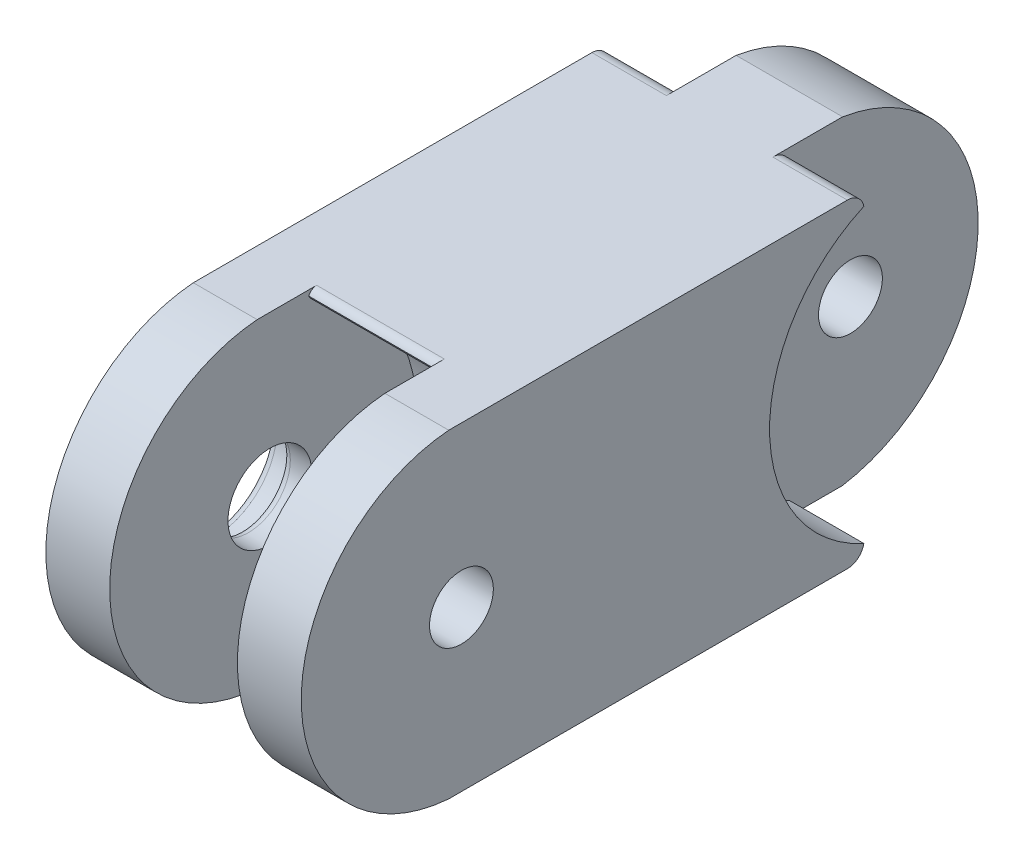
ISO-10303-21;
HEADER;
FILE_DESCRIPTION(('STEP AP214'),'2;1');
FILE_NAME('part.step','',(''),(''),'','','');
FILE_SCHEMA(('AUTOMOTIVE_DESIGN { 1 0 10303 214 1 1 1 1 }'));
ENDSEC;
DATA;
#1=APPLICATION_CONTEXT('core data for automotive mechanical design processes');
#2=APPLICATION_PROTOCOL_DEFINITION('international standard','automotive_design',2000,#1);
#3=PRODUCT_CONTEXT('',#1,'mechanical');
#4=PRODUCT('Part','Part','',(#3));
#5=PRODUCT_RELATED_PRODUCT_CATEGORY('part','',(#4));
#6=PRODUCT_DEFINITION_FORMATION('','',#4);
#7=PRODUCT_DEFINITION_CONTEXT('part definition',#1,'design');
#8=PRODUCT_DEFINITION('design','',#6,#7);
#9=PRODUCT_DEFINITION_SHAPE('','',#8);
#10=(LENGTH_UNIT() NAMED_UNIT(*) SI_UNIT(.MILLI.,.METRE.));
#11=(NAMED_UNIT(*) PLANE_ANGLE_UNIT() SI_UNIT($,.RADIAN.));
#12=(NAMED_UNIT(*) SI_UNIT($,.STERADIAN.) SOLID_ANGLE_UNIT());
#13=UNCERTAINTY_MEASURE_WITH_UNIT(LENGTH_MEASURE(1.E-05),#10,'distance_accuracy_value','');
#14=(GEOMETRIC_REPRESENTATION_CONTEXT(3) GLOBAL_UNCERTAINTY_ASSIGNED_CONTEXT((#13)) GLOBAL_UNIT_ASSIGNED_CONTEXT((#10,
#11,#12)) REPRESENTATION_CONTEXT('',''));
#15=CARTESIAN_POINT('',(0.,0.,0.));
#16=DIRECTION('',(0.,0.,1.));
#17=DIRECTION('',(1.,0.,0.));
#18=AXIS2_PLACEMENT_3D('',#15,#16,#17);
#19=CARTESIAN_POINT('',(0.,19.05,0.));
#20=DIRECTION('',(0.,1.,0.));
#21=DIRECTION('',(0.,0.,1.));
#22=AXIS2_PLACEMENT_3D('',#19,#20,#21);
#23=PLANE('',#22);
#24=DIRECTION('',(0.,0.,-1.));
#25=VECTOR('',#24,1.);
#26=CARTESIAN_POINT('',(-10.795,19.05,-27.94));
#27=LINE('',#26,#25);
#28=CARTESIAN_POINT('',(-10.795,19.05,-23.7820035976858));
#29=VERTEX_POINT('',#28);
#30=CARTESIAN_POINT('',(-10.795,19.05,-27.94));
#31=VERTEX_POINT('',#30);
#32=EDGE_CURVE('E54',#29,#31,#27,.T.);
#33=ORIENTED_EDGE('',*,*,#32,.F.);
#34=DIRECTION('',(1.,0.,0.));
#35=VECTOR('',#34,1.);
#36=CARTESIAN_POINT('',(-15.24,19.05,-23.7820035976858));
#37=LINE('',#36,#35);
#38=CARTESIAN_POINT('',(-15.24,19.05,-23.7820035976858));
#39=VERTEX_POINT('',#38);
#40=EDGE_CURVE('E303',#29,#39,#37,.F.);
#41=ORIENTED_EDGE('',*,*,#40,.T.);
#42=DIRECTION('',(0.,0.,1.));
#43=VECTOR('',#42,1.);
#44=CARTESIAN_POINT('',(-15.24,19.05,-27.94));
#45=LINE('',#44,#43);
#46=CARTESIAN_POINT('',(-15.24,19.05,0.));
#47=VERTEX_POINT('',#46);
#48=EDGE_CURVE('E214',#39,#47,#45,.T.);
#49=ORIENTED_EDGE('',*,*,#48,.T.);
#50=DIRECTION('',(1.,0.,0.));
#51=VECTOR('',#50,1.);
#52=CARTESIAN_POINT('',(-15.24,19.05,0.));
#53=LINE('',#52,#51);
#54=CARTESIAN_POINT('',(-11.43,19.05,0.));
#55=VERTEX_POINT('',#54);
#56=EDGE_CURVE('E216',#47,#55,#53,.T.);
#57=ORIENTED_EDGE('',*,*,#56,.T.);
#58=DIRECTION('',(0.,0.,-1.));
#59=VECTOR('',#58,1.);
#60=CARTESIAN_POINT('',(-11.43,19.05,0.));
#61=LINE('',#60,#59);
#62=CARTESIAN_POINT('',(-11.43,19.05,-3.548));
#63=VERTEX_POINT('',#62);
#64=EDGE_CURVE('E330',#55,#63,#61,.T.);
#65=ORIENTED_EDGE('',*,*,#64,.T.);
#66=DIRECTION('',(1.,0.,0.));
#67=VECTOR('',#66,1.);
#68=CARTESIAN_POINT('',(0.,19.05,-3.548));
#69=LINE('',#68,#67);
#70=CARTESIAN_POINT('',(-3.81,19.05,-3.548));
#71=VERTEX_POINT('',#70);
#72=EDGE_CURVE('E248',#63,#71,#69,.T.);
#73=ORIENTED_EDGE('',*,*,#72,.T.);
#74=DIRECTION('',(0.,0.,-1.));
#75=VECTOR('',#74,1.);
#76=CARTESIAN_POINT('',(-3.81,19.05,0.));
#77=LINE('',#76,#75);
#78=CARTESIAN_POINT('',(-3.81,19.05,0.));
#79=VERTEX_POINT('',#78);
#80=EDGE_CURVE('E352',#79,#71,#77,.T.);
#81=ORIENTED_EDGE('',*,*,#80,.F.);
#82=DIRECTION('',(1.,0.,0.));
#83=VECTOR('',#82,1.);
#84=CARTESIAN_POINT('',(-3.81,19.05,0.));
#85=LINE('',#84,#83);
#86=CARTESIAN_POINT('',(0.,19.05,0.));
#87=VERTEX_POINT('',#86);
#88=EDGE_CURVE('E209',#79,#87,#85,.T.);
#89=ORIENTED_EDGE('',*,*,#88,.T.);
#90=DIRECTION('',(0.,0.,-1.));
#91=VECTOR('',#90,1.);
#92=CARTESIAN_POINT('',(0.,19.05,-27.94));
#93=LINE('',#92,#91);
#94=CARTESIAN_POINT('',(0.,19.05,-23.7820035976858));
#95=VERTEX_POINT('',#94);
#96=EDGE_CURVE('E220',#87,#95,#93,.T.);
#97=ORIENTED_EDGE('',*,*,#96,.T.);
#98=DIRECTION('',(1.,0.,0.));
#99=VECTOR('',#98,1.);
#100=CARTESIAN_POINT('',(-4.445,19.05,-23.7820035976858));
#101=LINE('',#100,#99);
#102=CARTESIAN_POINT('',(-4.445,19.05,-23.7820035976858));
#103=VERTEX_POINT('',#102);
#104=EDGE_CURVE('E177',#95,#103,#101,.F.);
#105=ORIENTED_EDGE('',*,*,#104,.T.);
#106=DIRECTION('',(0.,0.,1.));
#107=VECTOR('',#106,1.);
#108=CARTESIAN_POINT('',(-4.445,19.05,-27.94));
#109=LINE('',#108,#107);
#110=CARTESIAN_POINT('',(-4.445,19.05,-27.94));
#111=VERTEX_POINT('',#110);
#112=EDGE_CURVE('E61',#111,#103,#109,.T.);
#113=ORIENTED_EDGE('',*,*,#112,.F.);
#114=DIRECTION('',(-1.,0.,0.));
#115=VECTOR('',#114,1.);
#116=CARTESIAN_POINT('',(-4.445,19.05,-27.94));
#117=LINE('',#116,#115);
#118=EDGE_CURVE('E173',#111,#31,#117,.T.);
#119=ORIENTED_EDGE('',*,*,#118,.T.);
#120=EDGE_LOOP('',(#33,#41,#49,#57,#65,#73,#81,#89,#97,#105,#113,#119));
#121=FACE_BOUND('',#120,.T.);
#122=ADVANCED_FACE('F39',(#121),#23,.T.);
#123=CARTESIAN_POINT('',(0.,0.,0.));
#124=DIRECTION('',(0.,1.,0.));
#125=DIRECTION('',(0.,0.,1.));
#126=AXIS2_PLACEMENT_3D('',#123,#124,#125);
#127=PLANE('',#126);
#128=DIRECTION('',(0.,0.,1.));
#129=VECTOR('',#128,1.);
#130=CARTESIAN_POINT('',(-15.24,0.,-27.94));
#131=LINE('',#130,#129);
#132=CARTESIAN_POINT('',(-15.24,0.,-23.7820035976858));
#133=VERTEX_POINT('',#132);
#134=CARTESIAN_POINT('',(-15.24,0.,0.));
#135=VERTEX_POINT('',#134);
#136=EDGE_CURVE('E211',#133,#135,#131,.T.);
#137=ORIENTED_EDGE('',*,*,#136,.F.);
#138=DIRECTION('',(-1.,0.,0.));
#139=VECTOR('',#138,1.);
#140=CARTESIAN_POINT('',(0.,0.,-23.7820035976858));
#141=LINE('',#140,#139);
#142=CARTESIAN_POINT('',(-10.795,0.,-23.7820035976858));
#143=VERTEX_POINT('',#142);
#144=EDGE_CURVE('E295',#133,#143,#141,.F.);
#145=ORIENTED_EDGE('',*,*,#144,.T.);
#146=DIRECTION('',(0.,0.,1.));
#147=VECTOR('',#146,1.);
#148=CARTESIAN_POINT('',(-10.795,0.,-27.94));
#149=LINE('',#148,#147);
#150=CARTESIAN_POINT('',(-10.795,0.,-27.94));
#151=VERTEX_POINT('',#150);
#152=EDGE_CURVE('E466',#151,#143,#149,.T.);
#153=ORIENTED_EDGE('',*,*,#152,.F.);
#154=DIRECTION('',(-1.,0.,0.));
#155=VECTOR('',#154,1.);
#156=CARTESIAN_POINT('',(-4.445,0.,-27.94));
#157=LINE('',#156,#155);
#158=CARTESIAN_POINT('',(-4.445,0.,-27.94));
#159=VERTEX_POINT('',#158);
#160=EDGE_CURVE('E189',#159,#151,#157,.T.);
#161=ORIENTED_EDGE('',*,*,#160,.F.);
#162=DIRECTION('',(0.,0.,-1.));
#163=VECTOR('',#162,1.);
#164=CARTESIAN_POINT('',(-4.445,0.,-27.94));
#165=LINE('',#164,#163);
#166=CARTESIAN_POINT('',(-4.445,0.,-23.7820035976858));
#167=VERTEX_POINT('',#166);
#168=EDGE_CURVE('E179',#167,#159,#165,.T.);
#169=ORIENTED_EDGE('',*,*,#168,.F.);
#170=DIRECTION('',(-1.,0.,0.));
#171=VECTOR('',#170,1.);
#172=CARTESIAN_POINT('',(0.,0.,-23.7820035976858));
#173=LINE('',#172,#171);
#174=CARTESIAN_POINT('',(0.,0.,-23.7820035976858));
#175=VERTEX_POINT('',#174);
#176=EDGE_CURVE('E293',#167,#175,#173,.F.);
#177=ORIENTED_EDGE('',*,*,#176,.T.);
#178=DIRECTION('',(0.,0.,-1.));
#179=VECTOR('',#178,1.);
#180=CARTESIAN_POINT('',(0.,0.,-27.94));
#181=LINE('',#180,#179);
#182=CARTESIAN_POINT('',(0.,0.,0.));
#183=VERTEX_POINT('',#182);
#184=EDGE_CURVE('E217',#183,#175,#181,.T.);
#185=ORIENTED_EDGE('',*,*,#184,.F.);
#186=DIRECTION('',(1.,0.,0.));
#187=VECTOR('',#186,1.);
#188=CARTESIAN_POINT('',(-3.81,0.,0.));
#189=LINE('',#188,#187);
#190=CARTESIAN_POINT('',(-3.81,0.,0.));
#191=VERTEX_POINT('',#190);
#192=EDGE_CURVE('E206',#191,#183,#189,.T.);
#193=ORIENTED_EDGE('',*,*,#192,.F.);
#194=DIRECTION('',(0.,0.,-1.));
#195=VECTOR('',#194,1.);
#196=CARTESIAN_POINT('',(-3.81,0.,0.));
#197=LINE('',#196,#195);
#198=CARTESIAN_POINT('',(-3.81,0.,-3.548));
#199=VERTEX_POINT('',#198);
#200=EDGE_CURVE('E333',#191,#199,#197,.T.);
#201=ORIENTED_EDGE('',*,*,#200,.T.);
#202=DIRECTION('',(1.,0.,0.));
#203=VECTOR('',#202,1.);
#204=CARTESIAN_POINT('',(-11.43,0.,-3.548));
#205=LINE('',#204,#203);
#206=CARTESIAN_POINT('',(-11.43,0.,-3.548));
#207=VERTEX_POINT('',#206);
#208=EDGE_CURVE('E245',#199,#207,#205,.F.);
#209=ORIENTED_EDGE('',*,*,#208,.T.);
#210=DIRECTION('',(0.,0.,-1.));
#211=VECTOR('',#210,1.);
#212=CARTESIAN_POINT('',(-11.43,0.,0.));
#213=LINE('',#212,#211);
#214=CARTESIAN_POINT('',(-11.43,0.,0.));
#215=VERTEX_POINT('',#214);
#216=EDGE_CURVE('E273',#215,#207,#213,.T.);
#217=ORIENTED_EDGE('',*,*,#216,.F.);
#218=DIRECTION('',(1.,0.,0.));
#219=VECTOR('',#218,1.);
#220=CARTESIAN_POINT('',(-15.24,0.,0.));
#221=LINE('',#220,#219);
#222=EDGE_CURVE('E224',#135,#215,#221,.T.);
#223=ORIENTED_EDGE('',*,*,#222,.F.);
#224=EDGE_LOOP('',(#137,#145,#153,#161,#169,#177,#185,#193,#201,#209,#217,#223));
#225=FACE_BOUND('',#224,.T.);
#226=ADVANCED_FACE('F387',(#225),#127,.F.);
#227=CARTESIAN_POINT('',(-11.43,9.525,0.));
#228=DIRECTION('',(1.,0.,0.));
#229=DIRECTION('',(0.,0.,-1.));
#230=AXIS2_PLACEMENT_3D('',#227,#228,#229);
#231=CYLINDRICAL_SURFACE('',#230,9.525);
#232=CARTESIAN_POINT('',(-11.43,9.525,0.));
#233=DIRECTION('',(-1.,0.,0.));
#234=DIRECTION('',(0.,0.,1.));
#235=AXIS2_PLACEMENT_3D('',#232,#233,#234);
#236=CIRCLE('',#235,9.525);
#237=CARTESIAN_POINT('',(-11.43,18.4335182930583,-3.37104239401496));
#238=VERTEX_POINT('',#237);
#239=CARTESIAN_POINT('',(-11.43,0.616481706941728,-3.37104239401496));
#240=VERTEX_POINT('',#239);
#241=EDGE_CURVE('E359',#238,#240,#236,.T.);
#242=ORIENTED_EDGE('',*,*,#241,.T.);
#243=DIRECTION('',(1.,0.,0.));
#244=VECTOR('',#243,1.);
#245=CARTESIAN_POINT('',(-11.43,0.616481706941728,-3.37104239401496));
#246=LINE('',#245,#244);
#247=CARTESIAN_POINT('',(-3.81,0.616481706941728,-3.37104239401496));
#248=VERTEX_POINT('',#247);
#249=EDGE_CURVE('E242',#240,#248,#246,.T.);
#250=ORIENTED_EDGE('',*,*,#249,.T.);
#251=CARTESIAN_POINT('',(-3.81,9.525,0.));
#252=DIRECTION('',(-1.,0.,0.));
#253=DIRECTION('',(0.,0.,1.));
#254=AXIS2_PLACEMENT_3D('',#251,#252,#253);
#255=CIRCLE('',#254,9.525);
#256=CARTESIAN_POINT('',(-3.81,18.4335182930583,-3.37104239401496));
#257=VERTEX_POINT('',#256);
#258=EDGE_CURVE('E361',#257,#248,#255,.T.);
#259=ORIENTED_EDGE('',*,*,#258,.F.);
#260=DIRECTION('',(1.,0.,0.));
#261=VECTOR('',#260,1.);
#262=CARTESIAN_POINT('',(-11.43,18.4335182930583,-3.37104239401496));
#263=LINE('',#262,#261);
#264=EDGE_CURVE('E240',#257,#238,#263,.F.);
#265=ORIENTED_EDGE('',*,*,#264,.T.);
#266=EDGE_LOOP('',(#242,#250,#259,#265));
#267=FACE_BOUND('',#266,.T.);
#268=ADVANCED_FACE('F358',(#267),#231,.F.);
#269=CARTESIAN_POINT('',(-15.24,9.525,-0.756538375766052));
#270=DIRECTION('',(1.,0.,0.));
#271=DIRECTION('',(0.,0.,-1.));
#272=AXIS2_PLACEMENT_3D('',#269,#270,#271);
#273=CYLINDRICAL_SURFACE('',#272,1.905);
#274=CARTESIAN_POINT('',(0.,9.525,-0.756538375766052));
#275=DIRECTION('',(1.,0.,0.));
#276=DIRECTION('',(0.,0.,-1.));
#277=AXIS2_PLACEMENT_3D('',#274,#275,#276);
#278=CIRCLE('',#277,1.905);
#279=CARTESIAN_POINT('',(0.,9.525,-2.66153837576605));
#280=VERTEX_POINT('',#279);
#281=EDGE_CURVE('E363',#280,#280,#278,.T.);
#282=CARTESIAN_POINT('',(-3.81,9.525,-0.756538375766052));
#283=DIRECTION('',(1.,0.,0.));
#284=DIRECTION('',(0.,0.,-1.));
#285=AXIS2_PLACEMENT_3D('',#282,#283,#284);
#286=CIRCLE('',#285,1.905);
#287=CARTESIAN_POINT('',(-3.81,9.525,-2.66153837576605));
#288=VERTEX_POINT('',#287);
#289=EDGE_CURVE('E366',#288,#288,#286,.T.);
#290=CARTESIAN_POINT('',(0.,9.525,-2.66153837576605));
#291=CARTESIAN_POINT('',(-0.0396874999999998,9.525,-2.66153837576605));
#292=CARTESIAN_POINT('',(-0.0793749999999996,9.525,-2.66153837576605));
#293=CARTESIAN_POINT('',(-0.15875,9.525,-2.66153837576605));
#294=CARTESIAN_POINT('',(-0.1984375,9.525,-2.66153837576605));
#295=CARTESIAN_POINT('',(-0.2778125,9.525,-2.66153837576605));
#296=CARTESIAN_POINT('',(-0.3175,9.525,-2.66153837576605));
#297=CARTESIAN_POINT('',(-0.396875,9.525,-2.66153837576605));
#298=CARTESIAN_POINT('',(-0.436562500000001,9.525,-2.66153837576605));
#299=CARTESIAN_POINT('',(-0.515937500000001,9.525,-2.66153837576605));
#300=CARTESIAN_POINT('',(-0.555625000000001,9.525,-2.66153837576605));
#301=CARTESIAN_POINT('',(-0.635,9.525,-2.66153837576605));
#302=CARTESIAN_POINT('',(-0.6746875,9.525,-2.66153837576605));
#303=CARTESIAN_POINT('',(-0.7540625,9.525,-2.66153837576605));
#304=CARTESIAN_POINT('',(-0.793750000000001,9.525,-2.66153837576605));
#305=CARTESIAN_POINT('',(-0.873125000000001,9.525,-2.66153837576605));
#306=CARTESIAN_POINT('',(-0.9128125,9.525,-2.66153837576605));
#307=CARTESIAN_POINT('',(-0.9921875,9.525,-2.66153837576605));
#308=CARTESIAN_POINT('',(-1.031875,9.525,-2.66153837576605));
#309=CARTESIAN_POINT('',(-1.11125,9.525,-2.66153837576605));
#310=CARTESIAN_POINT('',(-1.1509375,9.525,-2.66153837576605));
#311=CARTESIAN_POINT('',(-1.2303125,9.525,-2.66153837576605));
#312=CARTESIAN_POINT('',(-1.27,9.525,-2.66153837576605));
#313=CARTESIAN_POINT('',(-1.349375,9.525,-2.66153837576605));
#314=CARTESIAN_POINT('',(-1.3890625,9.525,-2.66153837576605));
#315=CARTESIAN_POINT('',(-1.4684375,9.525,-2.66153837576605));
#316=CARTESIAN_POINT('',(-1.508125,9.525,-2.66153837576605));
#317=CARTESIAN_POINT('',(-1.5875,9.525,-2.66153837576605));
#318=CARTESIAN_POINT('',(-1.6271875,9.525,-2.66153837576605));
#319=CARTESIAN_POINT('',(-1.7065625,9.525,-2.66153837576605));
#320=CARTESIAN_POINT('',(-1.74625,9.525,-2.66153837576605));
#321=CARTESIAN_POINT('',(-1.825625,9.525,-2.66153837576605));
#322=CARTESIAN_POINT('',(-1.8653125,9.525,-2.66153837576605));
#323=CARTESIAN_POINT('',(-1.9446875,9.525,-2.66153837576605));
#324=CARTESIAN_POINT('',(-1.984375,9.525,-2.66153837576605));
#325=CARTESIAN_POINT('',(-2.06375,9.525,-2.66153837576605));
#326=CARTESIAN_POINT('',(-2.1034375,9.525,-2.66153837576605));
#327=CARTESIAN_POINT('',(-2.1828125,9.525,-2.66153837576605));
#328=CARTESIAN_POINT('',(-2.2225,9.525,-2.66153837576605));
#329=CARTESIAN_POINT('',(-2.301875,9.525,-2.66153837576605));
#330=CARTESIAN_POINT('',(-2.3415625,9.525,-2.66153837576605));
#331=CARTESIAN_POINT('',(-2.4209375,9.525,-2.66153837576605));
#332=CARTESIAN_POINT('',(-2.460625,9.525,-2.66153837576605));
#333=CARTESIAN_POINT('',(-2.54,9.525,-2.66153837576605));
#334=CARTESIAN_POINT('',(-2.5796875,9.525,-2.66153837576605));
#335=CARTESIAN_POINT('',(-2.6590625,9.525,-2.66153837576605));
#336=CARTESIAN_POINT('',(-2.69875,9.525,-2.66153837576605));
#337=CARTESIAN_POINT('',(-2.778125,9.525,-2.66153837576605));
#338=CARTESIAN_POINT('',(-2.8178125,9.525,-2.66153837576605));
#339=CARTESIAN_POINT('',(-2.8971875,9.525,-2.66153837576605));
#340=CARTESIAN_POINT('',(-2.936875,9.525,-2.66153837576605));
#341=CARTESIAN_POINT('',(-3.01625,9.525,-2.66153837576605));
#342=CARTESIAN_POINT('',(-3.0559375,9.525,-2.66153837576605));
#343=CARTESIAN_POINT('',(-3.1353125,9.525,-2.66153837576605));
#344=CARTESIAN_POINT('',(-3.175,9.525,-2.66153837576605));
#345=CARTESIAN_POINT('',(-3.254375,9.525,-2.66153837576605));
#346=CARTESIAN_POINT('',(-3.2940625,9.525,-2.66153837576605));
#347=CARTESIAN_POINT('',(-3.3734375,9.525,-2.66153837576605));
#348=CARTESIAN_POINT('',(-3.413125,9.525,-2.66153837576605));
#349=CARTESIAN_POINT('',(-3.4925,9.525,-2.66153837576605));
#350=CARTESIAN_POINT('',(-3.5321875,9.525,-2.66153837576605));
#351=CARTESIAN_POINT('',(-3.6115625,9.525,-2.66153837576605));
#352=CARTESIAN_POINT('',(-3.65125,9.525,-2.66153837576605));
#353=CARTESIAN_POINT('',(-3.730625,9.525,-2.66153837576605));
#354=CARTESIAN_POINT('',(-3.7703125,9.525,-2.66153837576605));
#355=CARTESIAN_POINT('',(-3.81,9.525,-2.66153837576605));
#356=B_SPLINE_CURVE_WITH_KNOTS('',3,(#290,#291,#292,#293,#294,#295,#296,#297,#298,#299,#300,
#301,#302,#303,#304,#305,#306,#307,#308,#309,#310,#311,#312,#313,#314,#315,#316,#317,#318,#319,
#320,#321,#322,#323,#324,#325,#326,#327,#328,#329,#330,#331,#332,#333,#334,#335,#336,#337,#338,
#339,#340,#341,#342,#343,#344,#345,#346,#347,#348,#349,#350,#351,#352,#353,#354,#355),
.UNSPECIFIED.,.F.,.F.,(4,2,2,2,2,2,2,2,2,2,2,2,2,2,2,2,2,2,2,2,2,2,2,2,2,2,2,2,2,2,2,2,4),(0.,
0.119062499999999,0.238125,0.3571875,0.476250000000001,0.5953125,0.714375,0.833437500000001,
0.9525,1.0715625,1.190625,1.3096875,1.42875,1.5478125,1.666875,1.7859375,1.905,2.0240625,
2.143125,2.2621875,2.38125,2.5003125,2.619375,2.7384375,2.8575,2.9765625,3.095625,3.2146875,
3.33375,3.4528125,3.571875,3.6909375,3.81),.UNSPECIFIED.);
#357=EDGE_CURVE('BSEAM376',#280,#288,#356,.T.);
#358=ORIENTED_EDGE('',*,*,#281,.T.);
#359=ORIENTED_EDGE('',*,*,#289,.F.);
#360=ORIENTED_EDGE('',*,*,#357,.T.);
#361=ORIENTED_EDGE('',*,*,#357,.F.);
#362=EDGE_LOOP('',(#358,#360,#359,#361));
#363=FACE_BOUND('',#362,.T.);
#364=ADVANCED_FACE('F376',(#363),#273,.F.);
#365=CARTESIAN_POINT('',(-15.24,19.05,-27.94));
#366=DIRECTION('',(1.,0.,0.));
#367=DIRECTION('',(0.,0.,-1.));
#368=AXIS2_PLACEMENT_3D('',#365,#366,#367);
#369=PLANE('',#368);
#370=CARTESIAN_POINT('',(-15.24,9.525,-0.756538375766052));
#371=DIRECTION('',(1.,0.,0.));
#372=DIRECTION('',(0.,0.,-1.));
#373=AXIS2_PLACEMENT_3D('',#370,#371,#372);
#374=CIRCLE('',#373,4.2500052);
#375=CARTESIAN_POINT('',(-15.24,9.525,-5.00654357576605));
#376=VERTEX_POINT('',#375);
#377=EDGE_CURVE('E231',#376,#376,#374,.T.);
#378=ORIENTED_EDGE('',*,*,#377,.T.);
#379=EDGE_LOOP('',(#378));
#380=FACE_BOUND('',#379,.T.);
#381=CARTESIAN_POINT('',(-15.24,9.525,-28.6966698920937));
#382=DIRECTION('',(1.,0.,0.));
#383=DIRECTION('',(0.,0.,-1.));
#384=AXIS2_PLACEMENT_3D('',#381,#382,#383);
#385=CIRCLE('',#384,9.555007814);
#386=CARTESIAN_POINT('',(-15.24,18.2336248159629,-24.765));
#387=VERTEX_POINT('',#386);
#388=CARTESIAN_POINT('',(-15.24,0.816375184037082,-24.765));
#389=VERTEX_POINT('',#388);
#390=EDGE_CURVE('E448',#387,#389,#385,.T.);
#391=ORIENTED_EDGE('',*,*,#390,.T.);
#392=CARTESIAN_POINT('',(-15.24,1.,-23.7820035976858));
#393=DIRECTION('',(1.,0.,0.));
#394=DIRECTION('',(0.,0.,-1.));
#395=AXIS2_PLACEMENT_3D('',#392,#393,#394);
#396=CIRCLE('',#395,1.);
#397=EDGE_CURVE('E291',#389,#133,#396,.F.);
#398=ORIENTED_EDGE('',*,*,#397,.T.);
#399=ORIENTED_EDGE('',*,*,#136,.T.);
#400=CARTESIAN_POINT('',(-15.24,9.525,-0.756538375766052));
#401=DIRECTION('',(1.,0.,0.));
#402=DIRECTION('',(0.,0.,-1.));
#403=AXIS2_PLACEMENT_3D('',#400,#401,#402);
#404=CIRCLE('',#403,9.5549974);
#405=EDGE_CURVE('E196',#47,#135,#404,.T.);
#406=ORIENTED_EDGE('',*,*,#405,.F.);
#407=ORIENTED_EDGE('',*,*,#48,.F.);
#408=CARTESIAN_POINT('',(-15.24,18.05,-23.7820035976858));
#409=DIRECTION('',(1.,0.,0.));
#410=DIRECTION('',(0.,0.,-1.));
#411=AXIS2_PLACEMENT_3D('',#408,#409,#410);
#412=CIRCLE('',#411,1.);
#413=EDGE_CURVE('E289',#39,#387,#412,.F.);
#414=ORIENTED_EDGE('',*,*,#413,.T.);
#415=EDGE_LOOP('',(#391,#398,#399,#406,#407,#414));
#416=FACE_BOUND('',#415,.T.);
#417=ADVANCED_FACE('F323',(#380,#416),#369,.F.);
#418=CARTESIAN_POINT('',(0.,19.05,-27.94));
#419=DIRECTION('',(-1.,0.,0.));
#420=DIRECTION('',(0.,0.,1.));
#421=AXIS2_PLACEMENT_3D('',#418,#419,#420);
#422=PLANE('',#421);
#423=ORIENTED_EDGE('',*,*,#184,.T.);
#424=CARTESIAN_POINT('',(0.,1.,-23.7820035976858));
#425=DIRECTION('',(-1.,0.,0.));
#426=DIRECTION('',(0.,0.,1.));
#427=AXIS2_PLACEMENT_3D('',#424,#425,#426);
#428=CIRCLE('',#427,1.);
#429=CARTESIAN_POINT('',(0.,0.816375184037084,-24.765));
#430=VERTEX_POINT('',#429);
#431=EDGE_CURVE('E300',#175,#430,#428,.F.);
#432=ORIENTED_EDGE('',*,*,#431,.T.);
#433=CARTESIAN_POINT('',(0.,9.525,-28.6966698920937));
#434=DIRECTION('',(1.,0.,0.));
#435=DIRECTION('',(0.,0.,-1.));
#436=AXIS2_PLACEMENT_3D('',#433,#434,#435);
#437=CIRCLE('',#436,9.555007814);
#438=CARTESIAN_POINT('',(0.,18.2336248159629,-24.765));
#439=VERTEX_POINT('',#438);
#440=EDGE_CURVE('E368',#439,#430,#437,.T.);
#441=ORIENTED_EDGE('',*,*,#440,.F.);
#442=CARTESIAN_POINT('',(0.,18.05,-23.7820035976858));
#443=DIRECTION('',(-1.,0.,0.));
#444=DIRECTION('',(0.,0.,1.));
#445=AXIS2_PLACEMENT_3D('',#442,#443,#444);
#446=CIRCLE('',#445,1.);
#447=EDGE_CURVE('E298',#439,#95,#446,.F.);
#448=ORIENTED_EDGE('',*,*,#447,.T.);
#449=ORIENTED_EDGE('',*,*,#96,.F.);
#450=CARTESIAN_POINT('',(0.,9.525,-0.756538375766052));
#451=DIRECTION('',(1.,0.,0.));
#452=DIRECTION('',(0.,0.,-1.));
#453=AXIS2_PLACEMENT_3D('',#450,#451,#452);
#454=CIRCLE('',#453,9.5549974);
#455=EDGE_CURVE('E202',#87,#183,#454,.T.);
#456=ORIENTED_EDGE('',*,*,#455,.T.);
#457=EDGE_LOOP('',(#423,#432,#441,#448,#449,#456));
#458=FACE_BOUND('',#457,.T.);
#459=ORIENTED_EDGE('',*,*,#281,.F.);
#460=EDGE_LOOP('',(#459));
#461=FACE_BOUND('',#460,.T.);
#462=ADVANCED_FACE('F384',(#458,#461),#422,.F.);
#463=CARTESIAN_POINT('',(-3.81,9.525,-0.756538375766052));
#464=DIRECTION('',(1.,0.,0.));
#465=DIRECTION('',(0.,0.,-1.));
#466=AXIS2_PLACEMENT_3D('',#463,#464,#465);
#467=CYLINDRICAL_SURFACE('',#466,9.5549974);
#468=ORIENTED_EDGE('',*,*,#455,.F.);
#469=ORIENTED_EDGE('',*,*,#88,.F.);
#470=CARTESIAN_POINT('',(-3.81,9.525,-0.756538375766052));
#471=DIRECTION('',(1.,0.,0.));
#472=DIRECTION('',(0.,0.,-1.));
#473=AXIS2_PLACEMENT_3D('',#470,#471,#472);
#474=CIRCLE('',#473,9.5549974);
#475=EDGE_CURVE('E204',#79,#191,#474,.T.);
#476=ORIENTED_EDGE('',*,*,#475,.T.);
#477=ORIENTED_EDGE('',*,*,#192,.T.);
#478=EDGE_LOOP('',(#468,#469,#476,#477));
#479=FACE_BOUND('',#478,.T.);
#480=ADVANCED_FACE('F398',(#479),#467,.T.);
#481=CARTESIAN_POINT('',(-3.81,9.525,-0.756538375766052));
#482=DIRECTION('',(1.,0.,0.));
#483=DIRECTION('',(0.,0.,-1.));
#484=AXIS2_PLACEMENT_3D('',#481,#482,#483);
#485=PLANE('',#484);
#486=ORIENTED_EDGE('',*,*,#200,.F.);
#487=ORIENTED_EDGE('',*,*,#475,.F.);
#488=ORIENTED_EDGE('',*,*,#80,.T.);
#489=CARTESIAN_POINT('',(-3.81,18.55,-3.548));
#490=DIRECTION('',(1.,0.,0.));
#491=DIRECTION('',(0.,0.,-1.));
#492=AXIS2_PLACEMENT_3D('',#489,#490,#491);
#493=CIRCLE('',#492,0.5);
#494=CARTESIAN_POINT('',(-3.81,18.7255785242997,-3.07984171287401));
#495=VERTEX_POINT('',#494);
#496=EDGE_CURVE('E260',#71,#495,#493,.T.);
#497=ORIENTED_EDGE('',*,*,#496,.T.);
#498=CARTESIAN_POINT('',(-3.81,18.9011570485994,-3.548));
#499=DIRECTION('',(1.,0.,0.));
#500=DIRECTION('',(0.,0.,-1.));
#501=AXIS2_PLACEMENT_3D('',#498,#499,#500);
#502=CIRCLE('',#501,0.5);
#503=EDGE_CURVE('E267',#495,#257,#502,.T.);
#504=ORIENTED_EDGE('',*,*,#503,.T.);
#505=ORIENTED_EDGE('',*,*,#258,.T.);
#506=CARTESIAN_POINT('',(-3.81,0.148842951400613,-3.548));
#507=DIRECTION('',(1.,0.,0.));
#508=DIRECTION('',(0.,0.,-1.));
#509=AXIS2_PLACEMENT_3D('',#506,#507,#508);
#510=CIRCLE('',#509,0.5);
#511=CARTESIAN_POINT('',(-3.81,0.324421475700308,-3.07984171287401));
#512=VERTEX_POINT('',#511);
#513=EDGE_CURVE('E251',#248,#512,#510,.T.);
#514=ORIENTED_EDGE('',*,*,#513,.T.);
#515=CARTESIAN_POINT('',(-3.81,0.5,-3.548));
#516=DIRECTION('',(1.,0.,0.));
#517=DIRECTION('',(0.,0.,-1.));
#518=AXIS2_PLACEMENT_3D('',#515,#516,#517);
#519=CIRCLE('',#518,0.5);
#520=EDGE_CURVE('E255',#512,#199,#519,.T.);
#521=ORIENTED_EDGE('',*,*,#520,.T.);
#522=EDGE_LOOP('',(#486,#487,#488,#497,#504,#505,#514,#521));
#523=FACE_BOUND('',#522,.T.);
#524=ORIENTED_EDGE('',*,*,#289,.T.);
#525=EDGE_LOOP('',(#524));
#526=FACE_BOUND('',#525,.T.);
#527=ADVANCED_FACE('F347',(#523,#526),#485,.F.);
#528=CARTESIAN_POINT('',(-15.24,9.525,-0.756538375766052));
#529=DIRECTION('',(1.,0.,0.));
#530=DIRECTION('',(0.,0.,-1.));
#531=AXIS2_PLACEMENT_3D('',#528,#529,#530);
#532=CYLINDRICAL_SURFACE('',#531,9.5549974);
#533=CARTESIAN_POINT('',(-11.43,9.525,-0.756538375766052));
#534=DIRECTION('',(1.,0.,0.));
#535=DIRECTION('',(0.,0.,-1.));
#536=AXIS2_PLACEMENT_3D('',#533,#534,#535);
#537=CIRCLE('',#536,9.5549974);
#538=EDGE_CURVE('E194',#55,#215,#537,.T.);
#539=ORIENTED_EDGE('',*,*,#538,.F.);
#540=ORIENTED_EDGE('',*,*,#56,.F.);
#541=ORIENTED_EDGE('',*,*,#405,.T.);
#542=ORIENTED_EDGE('',*,*,#222,.T.);
#543=EDGE_LOOP('',(#539,#540,#541,#542));
#544=FACE_BOUND('',#543,.T.);
#545=ADVANCED_FACE('F329',(#544),#532,.T.);
#546=CARTESIAN_POINT('',(-11.43,9.525,-0.756538375766052));
#547=DIRECTION('',(1.,0.,0.));
#548=DIRECTION('',(0.,0.,-1.));
#549=AXIS2_PLACEMENT_3D('',#546,#547,#548);
#550=PLANE('',#549);
#551=ORIENTED_EDGE('',*,*,#538,.T.);
#552=ORIENTED_EDGE('',*,*,#216,.T.);
#553=CARTESIAN_POINT('',(-11.43,0.5,-3.548));
#554=DIRECTION('',(1.,0.,0.));
#555=DIRECTION('',(0.,0.,-1.));
#556=AXIS2_PLACEMENT_3D('',#553,#554,#555);
#557=CIRCLE('',#556,0.5);
#558=CARTESIAN_POINT('',(-11.43,0.324421475700308,-3.07984171287401));
#559=VERTEX_POINT('',#558);
#560=EDGE_CURVE('E258',#207,#559,#557,.F.);
#561=ORIENTED_EDGE('',*,*,#560,.T.);
#562=CARTESIAN_POINT('',(-11.43,0.148842951400613,-3.548));
#563=DIRECTION('',(1.,0.,0.));
#564=DIRECTION('',(0.,0.,-1.));
#565=AXIS2_PLACEMENT_3D('',#562,#563,#564);
#566=CIRCLE('',#565,0.5);
#567=EDGE_CURVE('E253',#559,#240,#566,.F.);
#568=ORIENTED_EDGE('',*,*,#567,.T.);
#569=ORIENTED_EDGE('',*,*,#241,.F.);
#570=CARTESIAN_POINT('',(-11.43,18.9011570485994,-3.548));
#571=DIRECTION('',(1.,0.,0.));
#572=DIRECTION('',(0.,0.,-1.));
#573=AXIS2_PLACEMENT_3D('',#570,#571,#572);
#574=CIRCLE('',#573,0.5);
#575=CARTESIAN_POINT('',(-11.43,18.7255785242997,-3.07984171287401));
#576=VERTEX_POINT('',#575);
#577=EDGE_CURVE('E265',#238,#576,#574,.F.);
#578=ORIENTED_EDGE('',*,*,#577,.T.);
#579=CARTESIAN_POINT('',(-11.43,18.55,-3.548));
#580=DIRECTION('',(1.,0.,0.));
#581=DIRECTION('',(0.,0.,-1.));
#582=AXIS2_PLACEMENT_3D('',#579,#580,#581);
#583=CIRCLE('',#582,0.5);
#584=EDGE_CURVE('E262',#576,#63,#583,.F.);
#585=ORIENTED_EDGE('',*,*,#584,.T.);
#586=ORIENTED_EDGE('',*,*,#64,.F.);
#587=EDGE_LOOP('',(#551,#552,#561,#568,#569,#578,#585,#586));
#588=FACE_BOUND('',#587,.T.);
#589=CARTESIAN_POINT('',(-11.43,9.525,-0.756538375766052));
#590=DIRECTION('',(1.,0.,0.));
#591=DIRECTION('',(0.,0.,-1.));
#592=AXIS2_PLACEMENT_3D('',#589,#590,#591);
#593=CIRCLE('',#592,2.499995);
#594=CARTESIAN_POINT('',(-11.43,9.525,-3.25653337576605));
#595=VERTEX_POINT('',#594);
#596=EDGE_CURVE('E455',#595,#595,#593,.F.);
#597=ORIENTED_EDGE('',*,*,#596,.T.);
#598=EDGE_LOOP('',(#597));
#599=FACE_BOUND('',#598,.T.);
#600=ADVANCED_FACE('F336',(#588,#599),#550,.T.);
#601=CARTESIAN_POINT('',(-4.445,9.525,-26.3793978726146));
#602=DIRECTION('',(-1.,0.,0.));
#603=DIRECTION('',(0.,0.,1.));
#604=AXIS2_PLACEMENT_3D('',#601,#602,#603);
#605=CYLINDRICAL_SURFACE('',#604,9.652);
#606=CARTESIAN_POINT('',(-10.795,9.525,-26.3793978726146));
#607=DIRECTION('',(1.,0.,0.));
#608=DIRECTION('',(0.,0.,1.));
#609=AXIS2_PLACEMENT_3D('',#606,#607,#608);
#610=CIRCLE('',#609,9.652);
#611=EDGE_CURVE('E190',#151,#31,#610,.T.);
#612=ORIENTED_EDGE('',*,*,#611,.T.);
#613=ORIENTED_EDGE('',*,*,#118,.F.);
#614=CARTESIAN_POINT('',(-4.445,9.525,-26.3793978726146));
#615=DIRECTION('',(1.,0.,0.));
#616=DIRECTION('',(0.,0.,1.));
#617=AXIS2_PLACEMENT_3D('',#614,#615,#616);
#618=CIRCLE('',#617,9.652);
#619=EDGE_CURVE('E182',#159,#111,#618,.T.);
#620=ORIENTED_EDGE('',*,*,#619,.F.);
#621=ORIENTED_EDGE('',*,*,#160,.T.);
#622=EDGE_LOOP('',(#612,#613,#620,#621));
#623=FACE_BOUND('',#622,.T.);
#624=ADVANCED_FACE('F192',(#623),#605,.T.);
#625=CARTESIAN_POINT('',(-4.445,9.525,-26.3793978726146));
#626=DIRECTION('',(-1.,0.,0.));
#627=DIRECTION('',(0.,0.,1.));
#628=AXIS2_PLACEMENT_3D('',#625,#626,#627);
#629=PLANE('',#628);
#630=CARTESIAN_POINT('',(-4.445,9.525,-28.4113978726146));
#631=DIRECTION('',(-1.,0.,0.));
#632=DIRECTION('',(0.,0.,1.));
#633=AXIS2_PLACEMENT_3D('',#630,#631,#632);
#634=CIRCLE('',#633,1.905);
#635=CARTESIAN_POINT('',(-4.445,9.525,-26.5063978726146));
#636=VERTEX_POINT('',#635);
#637=EDGE_CURVE('E277',#636,#636,#634,.T.);
#638=ORIENTED_EDGE('',*,*,#637,.T.);
#639=EDGE_LOOP('',(#638));
#640=FACE_BOUND('',#639,.T.);
#641=CARTESIAN_POINT('',(-4.445,9.525,-28.6966698920937));
#642=DIRECTION('',(1.,0.,0.));
#643=DIRECTION('',(0.,0.,-1.));
#644=AXIS2_PLACEMENT_3D('',#641,#642,#643);
#645=CIRCLE('',#644,9.555007814);
#646=CARTESIAN_POINT('',(-4.445,18.2336248159629,-24.765));
#647=VERTEX_POINT('',#646);
#648=CARTESIAN_POINT('',(-4.445,0.816375184037085,-24.765));
#649=VERTEX_POINT('',#648);
#650=EDGE_CURVE('E442',#647,#649,#645,.T.);
#651=ORIENTED_EDGE('',*,*,#650,.T.);
#652=CARTESIAN_POINT('',(-4.445,1.,-23.7820035976858));
#653=DIRECTION('',(-1.,0.,0.));
#654=DIRECTION('',(0.,0.,1.));
#655=AXIS2_PLACEMENT_3D('',#652,#653,#654);
#656=CIRCLE('',#655,1.);
#657=EDGE_CURVE('E307',#649,#167,#656,.T.);
#658=ORIENTED_EDGE('',*,*,#657,.T.);
#659=ORIENTED_EDGE('',*,*,#168,.T.);
#660=ORIENTED_EDGE('',*,*,#619,.T.);
#661=ORIENTED_EDGE('',*,*,#112,.T.);
#662=CARTESIAN_POINT('',(-4.445,18.05,-23.7820035976858));
#663=DIRECTION('',(-1.,0.,0.));
#664=DIRECTION('',(0.,0.,1.));
#665=AXIS2_PLACEMENT_3D('',#662,#663,#664);
#666=CIRCLE('',#665,1.);
#667=EDGE_CURVE('E11',#103,#647,#666,.T.);
#668=ORIENTED_EDGE('',*,*,#667,.T.);
#669=EDGE_LOOP('',(#651,#658,#659,#660,#661,#668));
#670=FACE_BOUND('',#669,.T.);
#671=ADVANCED_FACE('F184',(#640,#670),#629,.F.);
#672=CARTESIAN_POINT('',(-10.795,9.525,-26.3793978726146));
#673=DIRECTION('',(-1.,0.,0.));
#674=DIRECTION('',(0.,0.,1.));
#675=AXIS2_PLACEMENT_3D('',#672,#673,#674);
#676=PLANE('',#675);
#677=CARTESIAN_POINT('',(-10.795,9.525,-28.4113978726146));
#678=DIRECTION('',(-1.,0.,0.));
#679=DIRECTION('',(0.,0.,1.));
#680=AXIS2_PLACEMENT_3D('',#677,#678,#679);
#681=CIRCLE('',#680,1.905);
#682=CARTESIAN_POINT('',(-10.795,9.525,-26.5063978726146));
#683=VERTEX_POINT('',#682);
#684=EDGE_CURVE('E463',#683,#683,#681,.T.);
#685=ORIENTED_EDGE('',*,*,#684,.F.);
#686=EDGE_LOOP('',(#685));
#687=FACE_BOUND('',#686,.T.);
#688=CARTESIAN_POINT('',(-10.795,9.525,-28.6966698920937));
#689=DIRECTION('',(1.,0.,0.));
#690=DIRECTION('',(0.,0.,-1.));
#691=AXIS2_PLACEMENT_3D('',#688,#689,#690);
#692=CIRCLE('',#691,9.555007814);
#693=CARTESIAN_POINT('',(-10.795,18.2336248159629,-24.765));
#694=VERTEX_POINT('',#693);
#695=CARTESIAN_POINT('',(-10.795,0.81637518403708,-24.765));
#696=VERTEX_POINT('',#695);
#697=EDGE_CURVE('E313',#694,#696,#692,.T.);
#698=ORIENTED_EDGE('',*,*,#697,.F.);
#699=CARTESIAN_POINT('',(-10.795,18.05,-23.7820035976858));
#700=DIRECTION('',(-1.,0.,0.));
#701=DIRECTION('',(0.,0.,1.));
#702=AXIS2_PLACEMENT_3D('',#699,#700,#701);
#703=CIRCLE('',#702,1.);
#704=EDGE_CURVE('E47',#694,#29,#703,.F.);
#705=ORIENTED_EDGE('',*,*,#704,.T.);
#706=ORIENTED_EDGE('',*,*,#32,.T.);
#707=ORIENTED_EDGE('',*,*,#611,.F.);
#708=ORIENTED_EDGE('',*,*,#152,.T.);
#709=CARTESIAN_POINT('',(-10.795,1.,-23.7820035976858));
#710=DIRECTION('',(-1.,0.,0.));
#711=DIRECTION('',(0.,0.,1.));
#712=AXIS2_PLACEMENT_3D('',#709,#710,#711);
#713=CIRCLE('',#712,1.);
#714=EDGE_CURVE('E305',#143,#696,#713,.F.);
#715=ORIENTED_EDGE('',*,*,#714,.T.);
#716=EDGE_LOOP('',(#698,#705,#706,#707,#708,#715));
#717=FACE_BOUND('',#716,.T.);
#718=ADVANCED_FACE('F311',(#687,#717),#676,.T.);
#719=CARTESIAN_POINT('',(0.,9.525,-28.6966698920937));
#720=DIRECTION('',(-1.,0.,0.));
#721=DIRECTION('',(0.,0.,1.));
#722=AXIS2_PLACEMENT_3D('',#719,#720,#721);
#723=CYLINDRICAL_SURFACE('',#722,9.555007814);
#724=DIRECTION('',(-1.,0.,0.));
#725=VECTOR('',#724,1.);
#726=CARTESIAN_POINT('',(0.,18.2336248159629,-24.765));
#727=LINE('',#726,#725);
#728=EDGE_CURVE('E286',#439,#647,#727,.T.);
#729=ORIENTED_EDGE('',*,*,#728,.F.);
#730=ORIENTED_EDGE('',*,*,#440,.T.);
#731=DIRECTION('',(-1.,0.,0.));
#732=VECTOR('',#731,1.);
#733=CARTESIAN_POINT('',(0.,0.816375184037084,-24.765));
#734=LINE('',#733,#732);
#735=EDGE_CURVE('E283',#649,#430,#734,.F.);
#736=ORIENTED_EDGE('',*,*,#735,.F.);
#737=ORIENTED_EDGE('',*,*,#650,.F.);
#738=EDGE_LOOP('',(#729,#730,#736,#737));
#739=FACE_BOUND('',#738,.T.);
#740=ADVANCED_FACE('F445',(#739),#723,.F.);
#741=CARTESIAN_POINT('',(-10.795,9.525,-28.6966698920937));
#742=DIRECTION('',(-1.,0.,0.));
#743=DIRECTION('',(0.,0.,1.));
#744=AXIS2_PLACEMENT_3D('',#741,#742,#743);
#745=CYLINDRICAL_SURFACE('',#744,9.555007814);
#746=DIRECTION('',(-1.,0.,0.));
#747=VECTOR('',#746,1.);
#748=CARTESIAN_POINT('',(-10.795,18.2336248159629,-24.765));
#749=LINE('',#748,#747);
#750=EDGE_CURVE('E280',#694,#387,#749,.T.);
#751=ORIENTED_EDGE('',*,*,#750,.F.);
#752=ORIENTED_EDGE('',*,*,#697,.T.);
#753=DIRECTION('',(-1.,0.,0.));
#754=VECTOR('',#753,1.);
#755=CARTESIAN_POINT('',(-10.795,0.81637518403708,-24.765));
#756=LINE('',#755,#754);
#757=EDGE_CURVE('E269',#389,#696,#756,.F.);
#758=ORIENTED_EDGE('',*,*,#757,.F.);
#759=ORIENTED_EDGE('',*,*,#390,.F.);
#760=EDGE_LOOP('',(#751,#752,#758,#759));
#761=FACE_BOUND('',#760,.T.);
#762=ADVANCED_FACE('F473',(#761),#745,.F.);
#763=CARTESIAN_POINT('',(-13.208,11.4000026,-0.756538375766052));
#764=DIRECTION('',(1.,0.,0.));
#765=DIRECTION('',(0.,0.,-1.));
#766=AXIS2_PLACEMENT_3D('',#763,#764,#765);
#767=PLANE('',#766);
#768=CARTESIAN_POINT('',(-13.208,9.525,-0.756538375766052));
#769=DIRECTION('',(1.,0.,0.));
#770=DIRECTION('',(0.,0.,-1.));
#771=AXIS2_PLACEMENT_3D('',#768,#769,#770);
#772=CIRCLE('',#771,2.999995);
#773=CARTESIAN_POINT('',(-13.208,9.525,-3.75653337576605));
#774=VERTEX_POINT('',#773);
#775=EDGE_CURVE('E237',#774,#774,#772,.T.);
#776=ORIENTED_EDGE('',*,*,#775,.T.);
#777=EDGE_LOOP('',(#776));
#778=FACE_BOUND('',#777,.T.);
#779=CARTESIAN_POINT('',(-13.208,9.525,-0.756538375766052));
#780=DIRECTION('',(-1.,0.,0.));
#781=DIRECTION('',(0.,0.,1.));
#782=AXIS2_PLACEMENT_3D('',#779,#780,#781);
#783=CIRCLE('',#782,3.7500052);
#784=CARTESIAN_POINT('',(-13.208,9.525,2.99346682423395));
#785=VERTEX_POINT('',#784);
#786=EDGE_CURVE('E452',#785,#785,#783,.T.);
#787=ORIENTED_EDGE('',*,*,#786,.T.);
#788=EDGE_LOOP('',(#787));
#789=FACE_BOUND('',#788,.T.);
#790=ADVANCED_FACE('F475',(#778,#789),#767,.F.);
#791=CARTESIAN_POINT('',(-15.24,9.525,-0.756538375766052));
#792=DIRECTION('',(-1.,0.,0.));
#793=DIRECTION('',(0.,0.,1.));
#794=AXIS2_PLACEMENT_3D('',#791,#792,#793);
#795=CYLINDRICAL_SURFACE('',#794,3.7500052);
#796=CARTESIAN_POINT('',(-14.74,9.525,-0.756538375766052));
#797=DIRECTION('',(1.,0.,0.));
#798=DIRECTION('',(0.,0.,-1.));
#799=AXIS2_PLACEMENT_3D('',#796,#797,#798);
#800=CIRCLE('',#799,3.7500052);
#801=CARTESIAN_POINT('',(-14.74,9.525,-4.50654357576605));
#802=VERTEX_POINT('',#801);
#803=EDGE_CURVE('E222',#802,#802,#800,.F.);
#804=ORIENTED_EDGE('',*,*,#803,.T.);
#805=EDGE_LOOP('',(#804));
#806=FACE_BOUND('',#805,.T.);
#807=ORIENTED_EDGE('',*,*,#786,.F.);
#808=EDGE_LOOP('',(#807));
#809=FACE_BOUND('',#808,.T.);
#810=ADVANCED_FACE('F481',(#806,#809),#795,.F.);
#811=CARTESIAN_POINT('',(-4.35894633027014,9.525,-0.756538375766052));
#812=DIRECTION('',(-1.,0.,0.));
#813=DIRECTION('',(0.,0.,1.));
#814=AXIS2_PLACEMENT_3D('',#811,#812,#813);
#815=CYLINDRICAL_SURFACE('',#814,2.499995);
#816=CARTESIAN_POINT('',(-12.708,9.525,-0.756538375766052));
#817=DIRECTION('',(1.,0.,0.));
#818=DIRECTION('',(0.,0.,-1.));
#819=AXIS2_PLACEMENT_3D('',#816,#817,#818);
#820=CIRCLE('',#819,2.499995);
#821=CARTESIAN_POINT('',(-12.708,9.525,-3.25653337576605));
#822=VERTEX_POINT('',#821);
#823=EDGE_CURVE('E234',#822,#822,#820,.F.);
#824=ORIENTED_EDGE('',*,*,#823,.T.);
#825=EDGE_LOOP('',(#824));
#826=FACE_BOUND('',#825,.T.);
#827=ORIENTED_EDGE('',*,*,#596,.F.);
#828=EDGE_LOOP('',(#827));
#829=FACE_BOUND('',#828,.T.);
#830=ADVANCED_FACE('F408',(#826,#829),#815,.F.);
#831=CARTESIAN_POINT('',(-14.74,9.525,-0.756538375766052));
#832=DIRECTION('',(1.,0.,0.));
#833=DIRECTION('',(0.,0.,-1.));
#834=AXIS2_PLACEMENT_3D('',#831,#832,#833);
#835=TOROIDAL_SURFACE('',#834,4.2500052,0.5);
#836=ORIENTED_EDGE('',*,*,#377,.F.);
#837=EDGE_LOOP('',(#836));
#838=FACE_BOUND('',#837,.T.);
#839=ORIENTED_EDGE('',*,*,#803,.F.);
#840=EDGE_LOOP('',(#839));
#841=FACE_BOUND('',#840,.T.);
#842=ADVANCED_FACE('F404',(#838,#841),#835,.T.);
#843=CARTESIAN_POINT('',(-12.708,9.525,-0.756538375766052));
#844=DIRECTION('',(1.,0.,0.));
#845=DIRECTION('',(0.,0.,-1.));
#846=AXIS2_PLACEMENT_3D('',#843,#844,#845);
#847=TOROIDAL_SURFACE('',#846,2.999995,0.5);
#848=ORIENTED_EDGE('',*,*,#775,.F.);
#849=EDGE_LOOP('',(#848));
#850=FACE_BOUND('',#849,.T.);
#851=ORIENTED_EDGE('',*,*,#823,.F.);
#852=EDGE_LOOP('',(#851));
#853=FACE_BOUND('',#852,.T.);
#854=ADVANCED_FACE('F407',(#850,#853),#847,.T.);
#855=CARTESIAN_POINT('',(-11.43,0.5,-3.548));
#856=DIRECTION('',(-1.,0.,0.));
#857=DIRECTION('',(0.,0.,1.));
#858=AXIS2_PLACEMENT_3D('',#855,#856,#857);
#859=CYLINDRICAL_SURFACE('',#858,0.5);
#860=DIRECTION('',(-1.,0.,0.));
#861=VECTOR('',#860,1.);
#862=CARTESIAN_POINT('',(-7.62,0.324421475700308,-3.07984171287401));
#863=LINE('',#862,#861);
#864=EDGE_CURVE('E270',#559,#512,#863,.F.);
#865=ORIENTED_EDGE('',*,*,#864,.F.);
#866=ORIENTED_EDGE('',*,*,#560,.F.);
#867=ORIENTED_EDGE('',*,*,#208,.F.);
#868=ORIENTED_EDGE('',*,*,#520,.F.);
#869=EDGE_LOOP('',(#865,#866,#867,#868));
#870=FACE_BOUND('',#869,.T.);
#871=ADVANCED_FACE('F412',(#870),#859,.T.);
#872=CARTESIAN_POINT('',(-11.43,0.148842951400613,-3.548));
#873=DIRECTION('',(1.,0.,0.));
#874=DIRECTION('',(0.,0.,-1.));
#875=AXIS2_PLACEMENT_3D('',#872,#873,#874);
#876=CYLINDRICAL_SURFACE('',#875,0.5);
#877=ORIENTED_EDGE('',*,*,#567,.F.);
#878=ORIENTED_EDGE('',*,*,#864,.T.);
#879=ORIENTED_EDGE('',*,*,#513,.F.);
#880=ORIENTED_EDGE('',*,*,#249,.F.);
#881=EDGE_LOOP('',(#877,#878,#879,#880));
#882=FACE_BOUND('',#881,.T.);
#883=ADVANCED_FACE('F414',(#882),#876,.T.);
#884=CARTESIAN_POINT('',(-11.43,18.9011570485994,-3.548));
#885=DIRECTION('',(1.,0.,0.));
#886=DIRECTION('',(0.,0.,-1.));
#887=AXIS2_PLACEMENT_3D('',#884,#885,#886);
#888=CYLINDRICAL_SURFACE('',#887,0.5);
#889=DIRECTION('',(1.,0.,0.));
#890=VECTOR('',#889,1.);
#891=CARTESIAN_POINT('',(-7.62,18.7255785242997,-3.07984171287401));
#892=LINE('',#891,#890);
#893=EDGE_CURVE('E274',#576,#495,#892,.T.);
#894=ORIENTED_EDGE('',*,*,#893,.F.);
#895=ORIENTED_EDGE('',*,*,#577,.F.);
#896=ORIENTED_EDGE('',*,*,#264,.F.);
#897=ORIENTED_EDGE('',*,*,#503,.F.);
#898=EDGE_LOOP('',(#894,#895,#896,#897));
#899=FACE_BOUND('',#898,.T.);
#900=ADVANCED_FACE('F355',(#899),#888,.T.);
#901=CARTESIAN_POINT('',(0.,18.55,-3.548));
#902=DIRECTION('',(1.,0.,0.));
#903=DIRECTION('',(0.,0.,-1.));
#904=AXIS2_PLACEMENT_3D('',#901,#902,#903);
#905=CYLINDRICAL_SURFACE('',#904,0.5);
#906=ORIENTED_EDGE('',*,*,#584,.F.);
#907=ORIENTED_EDGE('',*,*,#893,.T.);
#908=ORIENTED_EDGE('',*,*,#496,.F.);
#909=ORIENTED_EDGE('',*,*,#72,.F.);
#910=EDGE_LOOP('',(#906,#907,#908,#909));
#911=FACE_BOUND('',#910,.T.);
#912=ADVANCED_FACE('F343',(#911),#905,.T.);
#913=CARTESIAN_POINT('',(0.,9.525,-28.4113978726146));
#914=DIRECTION('',(-1.,0.,0.));
#915=DIRECTION('',(0.,0.,1.));
#916=AXIS2_PLACEMENT_3D('',#913,#914,#915);
#917=CYLINDRICAL_SURFACE('',#916,1.905);
#918=ORIENTED_EDGE('',*,*,#684,.T.);
#919=EDGE_LOOP('',(#918));
#920=FACE_BOUND('',#919,.T.);
#921=ORIENTED_EDGE('',*,*,#637,.F.);
#922=EDGE_LOOP('',(#921));
#923=FACE_BOUND('',#922,.T.);
#924=ADVANCED_FACE('F423',(#920,#923),#917,.F.);
#925=CARTESIAN_POINT('',(-10.795,1.,-23.7820035976858));
#926=DIRECTION('',(-1.,0.,0.));
#927=DIRECTION('',(0.,0.,1.));
#928=AXIS2_PLACEMENT_3D('',#925,#926,#927);
#929=CYLINDRICAL_SURFACE('',#928,1.);
#930=ORIENTED_EDGE('',*,*,#714,.F.);
#931=ORIENTED_EDGE('',*,*,#144,.F.);
#932=ORIENTED_EDGE('',*,*,#397,.F.);
#933=ORIENTED_EDGE('',*,*,#757,.T.);
#934=EDGE_LOOP('',(#930,#931,#932,#933));
#935=FACE_BOUND('',#934,.T.);
#936=ADVANCED_FACE('F426',(#935),#929,.T.);
#937=CARTESIAN_POINT('',(0.,1.,-23.7820035976858));
#938=DIRECTION('',(-1.,0.,0.));
#939=DIRECTION('',(0.,0.,1.));
#940=AXIS2_PLACEMENT_3D('',#937,#938,#939);
#941=CYLINDRICAL_SURFACE('',#940,1.);
#942=ORIENTED_EDGE('',*,*,#431,.F.);
#943=ORIENTED_EDGE('',*,*,#176,.F.);
#944=ORIENTED_EDGE('',*,*,#657,.F.);
#945=ORIENTED_EDGE('',*,*,#735,.T.);
#946=EDGE_LOOP('',(#942,#943,#944,#945));
#947=FACE_BOUND('',#946,.T.);
#948=ADVANCED_FACE('F429',(#947),#941,.T.);
#949=CARTESIAN_POINT('',(-10.795,18.05,-23.7820035976858));
#950=DIRECTION('',(-1.,0.,0.));
#951=DIRECTION('',(0.,0.,1.));
#952=AXIS2_PLACEMENT_3D('',#949,#950,#951);
#953=CYLINDRICAL_SURFACE('',#952,1.);
#954=ORIENTED_EDGE('',*,*,#413,.F.);
#955=ORIENTED_EDGE('',*,*,#40,.F.);
#956=ORIENTED_EDGE('',*,*,#704,.F.);
#957=ORIENTED_EDGE('',*,*,#750,.T.);
#958=EDGE_LOOP('',(#954,#955,#956,#957));
#959=FACE_BOUND('',#958,.T.);
#960=ADVANCED_FACE('F317',(#959),#953,.T.);
#961=CARTESIAN_POINT('',(0.,18.05,-23.7820035976858));
#962=DIRECTION('',(-1.,0.,0.));
#963=DIRECTION('',(0.,0.,1.));
#964=AXIS2_PLACEMENT_3D('',#961,#962,#963);
#965=CYLINDRICAL_SURFACE('',#964,1.);
#966=ORIENTED_EDGE('',*,*,#667,.F.);
#967=ORIENTED_EDGE('',*,*,#104,.F.);
#968=ORIENTED_EDGE('',*,*,#447,.F.);
#969=ORIENTED_EDGE('',*,*,#728,.T.);
#970=EDGE_LOOP('',(#966,#967,#968,#969));
#971=FACE_BOUND('',#970,.T.);
#972=ADVANCED_FACE('F41',(#971),#965,.T.);
#973=CLOSED_SHELL('',(#122,#226,#268,#364,#417,#462,#480,#527,#545,#600,#624,#671,#718,#740,
#762,#790,#810,#830,#842,#854,#871,#883,#900,#912,#924,#936,#948,#960,#972));
#974=MANIFOLD_SOLID_BREP('B2',#973);
#975=ADVANCED_BREP_SHAPE_REPRESENTATION('',(#18,#974),#14);
#976=SHAPE_DEFINITION_REPRESENTATION(#9,#975);
ENDSEC;
END-ISO-10303-21;
